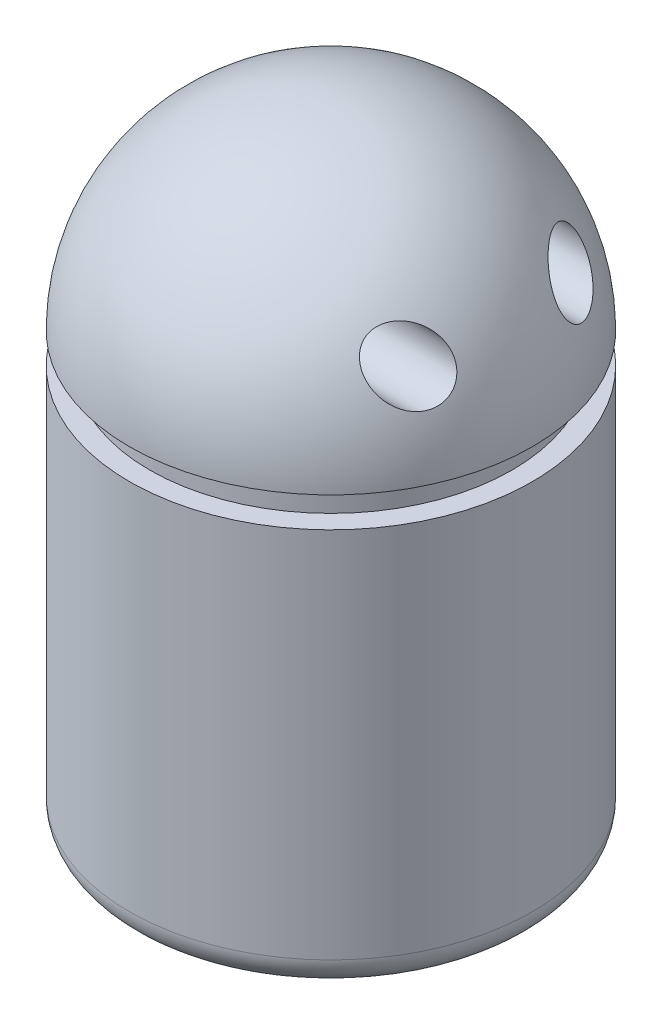
ISO-10303-21;
HEADER;
FILE_DESCRIPTION(('STEP AP214'),'2;1');
FILE_NAME('part.step','',(''),(''),'','','');
FILE_SCHEMA(('AUTOMOTIVE_DESIGN { 1 0 10303 214 1 1 1 1 }'));
ENDSEC;
DATA;
#1=APPLICATION_CONTEXT('core data for automotive mechanical design processes');
#2=APPLICATION_PROTOCOL_DEFINITION('international standard','automotive_design',2000,#1);
#3=PRODUCT_CONTEXT('',#1,'mechanical');
#4=PRODUCT('Part','Part','',(#3));
#5=PRODUCT_RELATED_PRODUCT_CATEGORY('part','',(#4));
#6=PRODUCT_DEFINITION_FORMATION('','',#4);
#7=PRODUCT_DEFINITION_CONTEXT('part definition',#1,'design');
#8=PRODUCT_DEFINITION('design','',#6,#7);
#9=PRODUCT_DEFINITION_SHAPE('','',#8);
#10=(LENGTH_UNIT() NAMED_UNIT(*) SI_UNIT(.MILLI.,.METRE.));
#11=(NAMED_UNIT(*) PLANE_ANGLE_UNIT() SI_UNIT($,.RADIAN.));
#12=(NAMED_UNIT(*) SI_UNIT($,.STERADIAN.) SOLID_ANGLE_UNIT());
#13=UNCERTAINTY_MEASURE_WITH_UNIT(LENGTH_MEASURE(1.E-05),#10,'distance_accuracy_value','');
#14=(GEOMETRIC_REPRESENTATION_CONTEXT(3) GLOBAL_UNCERTAINTY_ASSIGNED_CONTEXT((#13)) GLOBAL_UNIT_ASSIGNED_CONTEXT((#10,
#11,#12)) REPRESENTATION_CONTEXT('',''));
#15=CARTESIAN_POINT('',(0.,0.,0.));
#16=DIRECTION('',(0.,0.,1.));
#17=DIRECTION('',(1.,0.,0.));
#18=AXIS2_PLACEMENT_3D('',#15,#16,#17);
#19=CARTESIAN_POINT('',(0.,25.0871642546623,0.));
#20=DIRECTION('',(0.,1.,0.));
#21=DIRECTION('',(1.,0.,0.));
#22=AXIS2_PLACEMENT_3D('',#19,#20,#21);
#23=SPHERICAL_SURFACE('',#22,20.);
#24=CARTESIAN_POINT('',(0.,25.0871642546623,0.));
#25=DIRECTION('',(0.,1.,0.));
#26=DIRECTION('',(-1.,0.,0.));
#27=AXIS2_PLACEMENT_3D('',#24,#25,#26);
#28=CIRCLE('',#27,20.);
#29=CARTESIAN_POINT('',(-20.,25.0871642546623,0.));
#30=VERTEX_POINT('',#29);
#31=EDGE_CURVE('E112',#30,#30,#28,.T.);
#32=ORIENTED_EDGE('',*,*,#31,.T.);
#33=EDGE_LOOP('',(#32));
#34=FACE_BOUND('',#33,.T.);
#35=CARTESIAN_POINT('',(13.4453803624694,35.4923678170798,10.5334460521321));
#36=CARTESIAN_POINT('',(13.4831385515583,35.3560480628861,10.6199105739937));
#37=CARTESIAN_POINT('',(13.5313318289137,35.2148373811901,10.6939581733344));
#38=CARTESIAN_POINT('',(13.6442427149102,34.9283095678289,10.8173048911098));
#39=CARTESIAN_POINT('',(13.7089830796458,34.7829870281411,10.8665696481899));
#40=CARTESIAN_POINT('',(13.8500880606045,34.4939172377159,10.9414380525515));
#41=CARTESIAN_POINT('',(13.9263343192429,34.3501683330391,10.967265714894));
#42=CARTESIAN_POINT('',(14.0875707577707,34.0655193939873,10.9980236385453));
#43=CARTESIAN_POINT('',(14.1725620951018,33.9246197396809,11.0029511299904));
#44=CARTESIAN_POINT('',(14.3898642171455,33.5827313110201,10.9915922824336));
#45=CARTESIAN_POINT('',(14.5257628345021,33.384353064386,10.9643448851447));
#46=CARTESIAN_POINT('',(14.8049642687162,33.0015551148971,10.8735380860272));
#47=CARTESIAN_POINT('',(14.9482776658411,32.8171563385145,10.8099254174093));
#48=CARTESIAN_POINT('',(15.2392787226244,32.4642221290427,10.6490700218289));
#49=CARTESIAN_POINT('',(15.3869947818485,32.2958514701946,10.5515178584433));
#50=CARTESIAN_POINT('',(15.681879644939,31.9806023903941,10.3256252037855));
#51=CARTESIAN_POINT('',(15.8290483289229,31.8337284351558,10.1972783298105));
#52=CARTESIAN_POINT('',(16.1323426768213,31.5538219890677,9.89950538785618));
#53=CARTESIAN_POINT('',(16.2881051801146,31.4231722531734,9.72744563742472));
#54=CARTESIAN_POINT('',(16.590084390311,31.199277307521,9.3531448476486));
#55=CARTESIAN_POINT('',(16.7363118262348,31.1059894275718,9.15093860240877));
#56=CARTESIAN_POINT('',(16.9763118126462,30.9838115469594,8.77907702329936));
#57=CARTESIAN_POINT('',(17.0736593654515,30.9443742831044,8.61516345233622));
#58=CARTESIAN_POINT('',(17.2572573898673,30.8935716099865,8.27708875406138));
#59=CARTESIAN_POINT('',(17.3435228112316,30.8821679984158,8.10294190389709));
#60=CARTESIAN_POINT('',(17.4894142450262,30.8902167371029,7.77636744768058));
#61=CARTESIAN_POINT('',(17.5510968627123,30.9051688662297,7.62474723854912));
#62=CARTESIAN_POINT('',(17.6619820869591,30.9593980325332,7.32106813990853));
#63=CARTESIAN_POINT('',(17.711187968161,30.9986686777448,7.16900937612084));
#64=CARTESIAN_POINT('',(17.7740283006471,31.0764880833818,6.94397251996637));
#65=CARTESIAN_POINT('',(17.7931968677371,31.1057224982337,6.86920031870342));
#66=CARTESIAN_POINT('',(17.8275456182224,31.1704856736673,6.72150287856969));
#67=CARTESIAN_POINT('',(17.842727718818,31.2060113947727,6.64857676716854));
#68=CARTESIAN_POINT('',(17.8688802404139,31.2832207535645,6.50528978713338));
#69=CARTESIAN_POINT('',(17.879851688827,31.3249028856246,6.43492829652064));
#70=CARTESIAN_POINT('',(17.8974232257632,31.4141399134806,6.29749309543194));
#71=CARTESIAN_POINT('',(17.9040238311959,31.4616941140377,6.2304189970477));
#72=CARTESIAN_POINT('',(17.9161191012227,31.6014701462796,6.04961874530937));
#73=CARTESIAN_POINT('',(17.9167780081026,31.699710816695,5.94009529202683));
#74=CARTESIAN_POINT('',(17.903855130754,31.9105958706815,5.73709324226676));
#75=CARTESIAN_POINT('',(17.8902769302641,32.0232366232247,5.64361061491271));
#76=CARTESIAN_POINT('',(17.8503209367939,32.2549989474597,5.4779673889344));
#77=CARTESIAN_POINT('',(17.8244171437574,32.3737458588901,5.4051650033801));
#78=CARTESIAN_POINT('',(17.7611394566127,32.6176634396438,5.27763792350556));
#79=CARTESIAN_POINT('',(17.723763618381,32.7428351947643,5.2229162965286));
#80=CARTESIAN_POINT('',(17.6361103677206,33.0046819674143,5.12866296289856));
#81=CARTESIAN_POINT('',(17.5851434835901,33.1415704612395,5.0903743454242));
#82=CARTESIAN_POINT('',(17.4735005250467,33.4154711196541,5.03376476484332));
#83=CARTESIAN_POINT('',(17.4128202256916,33.5524833121425,5.01545251785937));
#84=CARTESIAN_POINT('',(17.2744789442787,33.8426516128093,4.99631712430197));
#85=CARTESIAN_POINT('',(17.1956301639029,33.9954203225939,4.99826244241785));
#86=CARTESIAN_POINT('',(17.0297545262585,34.2944640541906,5.02419626166686));
#87=CARTESIAN_POINT('',(16.9427229997045,34.4407352974281,5.04819741780212));
#88=CARTESIAN_POINT('',(16.7464902932733,34.7495240314543,5.12196397920605));
#89=CARTESIAN_POINT('',(16.6360833801165,34.9103689767533,5.1755209174127));
#90=CARTESIAN_POINT('',(16.4091937170986,35.2172880774052,5.30657532431823));
#91=CARTESIAN_POINT('',(16.2927076798265,35.3633541126322,5.38408586028323));
#92=CARTESIAN_POINT('',(16.0355303308101,35.6623724852479,5.57517532209032));
#93=CARTESIAN_POINT('',(15.8941126398515,35.8122132364643,5.69265943921267));
#94=CARTESIAN_POINT('',(15.60906843295,36.0863318760455,5.95242516587325));
#95=CARTESIAN_POINT('',(15.465439846816,36.2105840143231,6.09473149092368));
#96=CARTESIAN_POINT('',(15.1634789705839,36.4428988706325,6.4175672762193));
#97=CARTESIAN_POINT('',(15.0052627691149,36.5476886792573,6.60057755589191));
#98=CARTESIAN_POINT('',(14.6951125559464,36.7180439115649,6.98893175362697));
#99=CARTESIAN_POINT('',(14.5431740215666,36.7836380487796,7.19425919218186));
#100=CARTESIAN_POINT('',(14.2892576531945,36.8589004422977,7.56847654343141));
#101=CARTESIAN_POINT('',(14.1843775128908,36.8785296933862,7.73341151745024));
#102=CARTESIAN_POINT('',(13.9858677404892,36.8895083261498,8.07083330464297));
#103=CARTESIAN_POINT('',(13.8922198189739,36.8809043462227,8.24330719962286));
#104=CARTESIAN_POINT('',(13.7399095928964,36.8372056013013,8.55423823433762));
#105=CARTESIAN_POINT('',(13.6780601893566,36.8082373429673,8.6919919345829));
#106=CARTESIAN_POINT('',(13.5676903375387,36.7290832664489,8.96699100592251));
#107=CARTESIAN_POINT('',(13.5191635170006,36.678907621134,9.10423658895351));
#108=CARTESIAN_POINT('',(13.4588295603924,36.5869836249812,9.3069911950982));
#109=CARTESIAN_POINT('',(13.4407323484368,36.5533430381133,9.37440455268632));
#110=CARTESIAN_POINT('',(13.409231718004,36.4805588078798,9.50731508602419));
#111=CARTESIAN_POINT('',(13.3958257457582,36.4414181748885,9.57281328647429));
#112=CARTESIAN_POINT('',(13.3740501583254,36.3578443011119,9.70116157814492));
#113=CARTESIAN_POINT('',(13.3656773283825,36.3134144604112,9.7640133357836));
#114=CARTESIAN_POINT('',(13.3541808581406,36.2195892871721,9.88640192922896));
#115=CARTESIAN_POINT('',(13.3510566075058,36.1701945326912,9.94593914969092));
#116=CARTESIAN_POINT('',(13.350193564726,36.0723692784738,10.0549682391708));
#117=CARTESIAN_POINT('',(13.3519220996157,36.0243853878409,10.1048576102253));
#118=CARTESIAN_POINT('',(13.3596033271491,35.9252582873451,10.2010543075184));
#119=CARTESIAN_POINT('',(13.3655574496202,35.8741140134409,10.2473604153916));
#120=CARTESIAN_POINT('',(13.3895932369203,35.7166415701585,10.3803710602372));
#121=CARTESIAN_POINT('',(13.4138480142911,35.6062101929069,10.4612384205111));
#122=CARTESIAN_POINT('',(13.4453803624694,35.4923678170798,10.5334460521321));
#123=B_SPLINE_CURVE_WITH_KNOTS('',3,(#35,#36,#37,#38,#39,#40,#41,#42,#43,#44,#45,#46,#47,#48,
#49,#50,#51,#52,#53,#54,#55,#56,#57,#58,#59,#60,#61,#62,#63,#64,#65,#66,#67,#68,#69,#70,#71,#72,
#73,#74,#75,#76,#77,#78,#79,#80,#81,#82,#83,#84,#85,#86,#87,#88,#89,#90,#91,#92,#93,#94,#95,#96,
#97,#98,#99,#100,#101,#102,#103,#104,#105,#106,#107,#108,#109,#110,#111,#112,#113,#114,#115,
#116,#117,#118,#119,#120,#121,#122),.UNSPECIFIED.,.T.,.F.,(4,2,2,2,2,2,2,2,2,2,2,2,2,2,2,2,2,2,
2,2,2,2,2,2,2,2,2,2,2,2,2,2,2,2,2,2,2,2,2,2,2,2,2,4),(0.,0.496589031718136,0.993864698316754,
1.48633567664974,1.97887191927895,2.70103270944641,3.42425402002835,4.15424985801562,
4.88439713036922,5.67929855199498,6.47328952669972,7.05509791682352,7.63611301842491,
8.12725111990935,8.61826018367271,8.86558504956768,9.11279075143634,9.35993609590552,
9.60705220696593,10.0459918403922,10.4848210112505,10.907991973654,11.3312346888525,
11.7824527125496,12.2338675337831,12.7477023321604,13.2618321382933,13.8664631882613,
14.4714246630631,15.1800874077427,15.8894598395107,16.676677665557,17.4633180910052,
18.0505794890246,18.6368712802035,19.0964644654646,19.5558374404332,19.7879880674786,
20.020012121447,20.251887819697,20.4837365522084,20.6911605214273,20.8986547109362,
21.3133625829895),.UNSPECIFIED.);
#124=CARTESIAN_POINT('',(13.4453803624694,35.4923678170798,10.5334460521321));
#125=VERTEX_POINT('',#124);
#126=EDGE_CURVE('E69',#125,#125,#123,.T.);
#127=ORIENTED_EDGE('',*,*,#126,.F.);
#128=EDGE_LOOP('',(#127));
#129=FACE_BOUND('',#128,.T.);
#130=CARTESIAN_POINT('',(13.4453803624694,35.4923678170798,-10.5334460521321));
#131=CARTESIAN_POINT('',(13.4158646983301,35.598929537346,-10.4658556886057));
#132=CARTESIAN_POINT('',(13.3926840680982,35.7026123041998,-10.3906248174243));
#133=CARTESIAN_POINT('',(13.3607060949506,35.9008040454227,-10.2261234510468));
#134=CARTESIAN_POINT('',(13.3519232028405,35.9953037134903,-10.1368389487814));
#135=CARTESIAN_POINT('',(13.3494640912565,36.1720504139007,-9.94655570270381));
#136=CARTESIAN_POINT('',(13.3557969603757,36.2542900431139,-9.84554994603682));
#137=CARTESIAN_POINT('',(13.3830820607704,36.404169105101,-9.63511272506071));
#138=CARTESIAN_POINT('',(13.4040336809177,36.4718091480472,-9.52568161313875));
#139=CARTESIAN_POINT('',(13.4587464743722,36.590835521968,-9.30291438918817));
#140=CARTESIAN_POINT('',(13.4923747578717,36.6423806625916,-9.18962951774432));
#141=CARTESIAN_POINT('',(13.5704780506305,36.7301921799123,-8.96094782173622));
#142=CARTESIAN_POINT('',(13.6149587947713,36.7664504506784,-8.84554991047601));
#143=CARTESIAN_POINT('',(13.7332468560269,36.8364684166714,-8.56650527265603));
#144=CARTESIAN_POINT('',(13.8115350441136,36.8628244550972,-8.40288872505927));
#145=CARTESIAN_POINT('',(13.9808214851998,36.8889344208073,-8.08012363344789));
#146=CARTESIAN_POINT('',(14.0718460810461,36.8886323739835,-7.92098519252467));
#147=CARTESIAN_POINT('',(14.2893935805296,36.8608141336427,-7.56631562345827));
#148=CARTESIAN_POINT('',(14.4187114334163,36.8256872891957,-7.37309905703569));
#149=CARTESIAN_POINT('',(14.6855598643192,36.7214331798981,-7.00236574760609));
#150=CARTESIAN_POINT('',(14.8230946028621,36.6522885601276,-6.82485707292388));
#151=CARTESIAN_POINT('',(15.1039635536739,36.4826354489429,-6.48612535133025));
#152=CARTESIAN_POINT('',(15.2473503113133,36.3817255957484,-6.32514778248487));
#153=CARTESIAN_POINT('',(15.5346926788118,36.151839972101,-6.02516993282366));
#154=CARTESIAN_POINT('',(15.6786484827104,36.0228536374749,-5.88617795848116));
#155=CARTESIAN_POINT('',(15.9804735662073,35.722992018574,-5.61905505414908));
#156=CARTESIAN_POINT('',(16.1380274430434,35.5489980206046,-5.49403721011682));
#157=CARTESIAN_POINT('',(16.4452586947804,35.173119254424,-5.28176167011965));
#158=CARTESIAN_POINT('',(16.5949422020456,34.971256659002,-5.19447418099817));
#159=CARTESIAN_POINT('',(16.8470085332183,34.5955830029491,-5.08026825777102));
#160=CARTESIAN_POINT('',(16.9521849369037,34.4264881655973,-5.04393792281258));
#161=CARTESIAN_POINT('',(17.1518397814388,34.0784917493828,-5.00109654246142));
#162=CARTESIAN_POINT('',(17.2463326831365,33.8996039251471,-4.9945447069936));
#163=CARTESIAN_POINT('',(17.4069274345922,33.5662976716411,-5.0131578093004));
#164=CARTESIAN_POINT('',(17.4751479913268,33.4126214047409,-5.03334645782764));
#165=CARTESIAN_POINT('',(17.5993155059513,33.1054510937987,-5.0989801671158));
#166=CARTESIAN_POINT('',(17.6552653275532,32.9519570155726,-5.14441932621246));
#167=CARTESIAN_POINT('',(17.7282148284535,32.7252918882465,-5.23227231097536));
#168=CARTESIAN_POINT('',(17.7507704364888,32.6500373584656,-5.26501101500455));
#169=CARTESIAN_POINT('',(17.7918284654547,32.5016071859071,-5.33704858199191));
#170=CARTESIAN_POINT('',(17.8103329182706,32.4284305170664,-5.37634413880596));
#171=CARTESIAN_POINT('',(17.8430141252577,32.2849188299343,-5.46135477177209));
#172=CARTESIAN_POINT('',(17.8571923583894,32.2145828476769,-5.50706764628089));
#173=CARTESIAN_POINT('',(17.8810088473723,32.0775167352073,-5.60461604662418));
#174=CARTESIAN_POINT('',(17.8906477494486,32.0107860929323,-5.65645069963955));
#175=CARTESIAN_POINT('',(17.9107051989468,31.8329476401285,-5.80716748552025));
#176=CARTESIAN_POINT('',(17.9162444046389,31.7262650700169,-5.91208323881214));
#177=CARTESIAN_POINT('',(17.9124965592287,31.5299278493289,-6.13640813916594));
#178=CARTESIAN_POINT('',(17.9032147664524,31.4402671722004,-6.2558121320745));
#179=CARTESIAN_POINT('',(17.8712423769709,31.2846762479242,-6.49841641401209));
#180=CARTESIAN_POINT('',(17.849300271535,31.217728594321,-6.62106658654284));
#181=CARTESIAN_POINT('',(17.7935918475913,31.1022547031493,-6.87216546526775));
#182=CARTESIAN_POINT('',(17.7598242063723,31.0537305275516,-7.00061481871195));
#183=CARTESIAN_POINT('',(17.6797558248141,30.9731609499697,-7.26658430054409));
#184=CARTESIAN_POINT('',(17.6328987386091,30.9420939742314,-7.40423068629115));
#185=CARTESIAN_POINT('',(17.5292295718495,30.8996274366313,-7.6787622392922));
#186=CARTESIAN_POINT('',(17.4724134487415,30.8882358818377,-7.81564707404969));
#187=CARTESIAN_POINT('',(17.3425964541826,30.8835175840484,-8.1033724213904));
#188=CARTESIAN_POINT('',(17.2684532071469,30.8927110461314,-8.25373503364917));
#189=CARTESIAN_POINT('',(17.1117304385671,30.9322012762814,-8.54706463029031));
#190=CARTESIAN_POINT('',(17.0291462658822,30.9625097332649,-8.69002747116453));
#191=CARTESIAN_POINT('',(16.8425740480016,31.0487656204242,-8.99030276211326));
#192=CARTESIAN_POINT('',(16.7373514842278,31.1082344515853,-9.14583522807365));
#193=CARTESIAN_POINT('',(16.5204149875339,31.2494846808207,-9.44141745501021));
#194=CARTESIAN_POINT('',(16.4086974218015,31.3312786622471,-9.5814584216098));
#195=CARTESIAN_POINT('',(16.1608832870383,31.5301875170159,-9.86745219708467));
#196=CARTESIAN_POINT('',(16.0239497274398,31.6509821970311,-10.0101275016743));
#197=CARTESIAN_POINT('',(15.7470580488079,31.9150037900251,-10.2695809541939));
#198=CARTESIAN_POINT('',(15.6070973238967,32.0582507517159,-10.386335729097));
#199=CARTESIAN_POINT('',(15.3096891981131,32.3826279363443,-10.6045831562373));
#200=CARTESIAN_POINT('',(15.1522305162312,32.5662537933379,-10.7023751893496));
#201=CARTESIAN_POINT('',(14.8417987797107,32.9529946072782,-10.8589707855588));
#202=CARTESIAN_POINT('',(14.688823931401,33.1561016283162,-10.9177901481164));
#203=CARTESIAN_POINT('',(14.4236206562796,33.5340481340405,-10.9841736846133));
#204=CARTESIAN_POINT('',(14.3094720847854,33.7061366243991,-10.9997783484113));
#205=CARTESIAN_POINT('',(14.0917675490524,34.0571037669916,-11.0002163406899));
#206=CARTESIAN_POINT('',(13.9882018235543,34.2359759494655,-10.9850782992608));
#207=CARTESIAN_POINT('',(13.8188839743938,34.5555219145814,-10.9276830595413));
#208=CARTESIAN_POINT('',(13.7498725351796,34.6957074990701,-10.8923159905561));
#209=CARTESIAN_POINT('',(13.6251272921572,34.9743436264412,-10.7992995577861));
#210=CARTESIAN_POINT('',(13.5693475779758,35.1127985413618,-10.7417291155208));
#211=CARTESIAN_POINT('',(13.5076573394018,35.2895176475792,-10.6516455410847));
#212=CARTESIAN_POINT('',(13.4940219268909,35.3305665515595,-10.6295080562011));
#213=CARTESIAN_POINT('',(13.4684198427684,35.4120016169782,-10.5830884645494));
#214=CARTESIAN_POINT('',(13.4564542284101,35.4523873443699,-10.5588050147846));
#215=CARTESIAN_POINT('',(13.4453803624694,35.4923678170798,-10.5334460521321));
#216=B_SPLINE_CURVE_WITH_KNOTS('',3,(#130,#131,#132,#133,#134,#135,#136,#137,#138,#139,#140,
#141,#142,#143,#144,#145,#146,#147,#148,#149,#150,#151,#152,#153,#154,#155,#156,#157,#158,#159,
#160,#161,#162,#163,#164,#165,#166,#167,#168,#169,#170,#171,#172,#173,#174,#175,#176,#177,#178,
#179,#180,#181,#182,#183,#184,#185,#186,#187,#188,#189,#190,#191,#192,#193,#194,#195,#196,#197,
#198,#199,#200,#201,#202,#203,#204,#205,#206,#207,#208,#209,#210,#211,#212,#213,#214,#215),
.UNSPECIFIED.,.T.,.F.,(4,2,2,2,2,2,2,2,2,2,2,2,2,2,2,2,2,2,2,2,2,2,2,2,2,2,2,2,2,2,2,2,2,2,2,2,
2,2,2,2,2,2,4),(0.,0.388607904121306,0.777605610209473,1.16683726630109,1.55605265176642,
1.94129649488554,2.32674435913799,2.87359187660103,3.42158763965096,4.1233133949417,
4.82539752295709,5.53673505394516,6.24834069983095,7.04221043165986,7.83545214699752,
8.44039077551558,9.04450051930576,9.55053792035586,10.0564570977564,10.3114773399711,
10.566369380458,10.8211741857305,11.0759427056936,11.5225717734566,11.9690424173854,
12.3914857505695,12.8139763500308,13.2582462848364,13.7026969762453,14.2044876786893,
14.7065563852339,15.2952499387592,15.8842759912948,16.5766997574112,17.2697453816613,
18.0489306114634,18.827799767186,19.4468554731248,20.0653349287673,20.5442564273424,
21.021491067327,21.1671994959344,21.312999767052),.UNSPECIFIED.);
#217=CARTESIAN_POINT('',(13.4453803624694,35.4923678170798,-10.5334460521321));
#218=VERTEX_POINT('',#217);
#219=EDGE_CURVE('E51',#218,#218,#216,.T.);
#220=ORIENTED_EDGE('',*,*,#219,.F.);
#221=EDGE_LOOP('',(#220));
#222=FACE_BOUND('',#221,.T.);
#223=ADVANCED_FACE('F47',(#34,#129,#222),#23,.T.);
#224=CARTESIAN_POINT('',(0.,-17.9128357453377,0.));
#225=DIRECTION('',(0.,1.,0.));
#226=DIRECTION('',(-1.,0.,0.));
#227=AXIS2_PLACEMENT_3D('',#224,#225,#226);
#228=PLANE('',#227);
#229=CARTESIAN_POINT('',(0.,-17.9128357453377,0.));
#230=DIRECTION('',(0.,1.,0.));
#231=DIRECTION('',(-1.,0.,0.));
#232=AXIS2_PLACEMENT_3D('',#229,#230,#231);
#233=CIRCLE('',#232,17.);
#234=CARTESIAN_POINT('',(-17.,-17.9128357453377,0.));
#235=VERTEX_POINT('',#234);
#236=EDGE_CURVE('E12',#235,#235,#233,.F.);
#237=ORIENTED_EDGE('',*,*,#236,.T.);
#238=EDGE_LOOP('',(#237));
#239=FACE_BOUND('',#238,.T.);
#240=ADVANCED_FACE('F100',(#239),#228,.F.);
#241=CARTESIAN_POINT('',(0.,45.0871642546623,0.));
#242=DIRECTION('',(0.,1.,0.));
#243=DIRECTION('',(-1.,0.,0.));
#244=AXIS2_PLACEMENT_3D('',#241,#242,#243);
#245=CYLINDRICAL_SURFACE('',#244,20.);
#246=CARTESIAN_POINT('',(0.,-14.9128357453377,0.));
#247=DIRECTION('',(0.,1.,0.));
#248=DIRECTION('',(-1.,0.,0.));
#249=AXIS2_PLACEMENT_3D('',#246,#247,#248);
#250=CIRCLE('',#249,20.);
#251=CARTESIAN_POINT('',(-20.,-14.9128357453377,0.));
#252=VERTEX_POINT('',#251);
#253=EDGE_CURVE('E60',#252,#252,#250,.T.);
#254=ORIENTED_EDGE('',*,*,#253,.T.);
#255=EDGE_LOOP('',(#254));
#256=FACE_BOUND('',#255,.T.);
#257=CARTESIAN_POINT('',(0.,22.0839005854841,0.));
#258=DIRECTION('',(0.,1.,0.));
#259=DIRECTION('',(-1.,0.,0.));
#260=AXIS2_PLACEMENT_3D('',#257,#258,#259);
#261=CIRCLE('',#260,20.);
#262=CARTESIAN_POINT('',(-20.,22.0839005854841,0.));
#263=VERTEX_POINT('',#262);
#264=EDGE_CURVE('E66',#263,#263,#261,.T.);
#265=ORIENTED_EDGE('',*,*,#264,.F.);
#266=EDGE_LOOP('',(#265));
#267=FACE_BOUND('',#266,.T.);
#268=ADVANCED_FACE('F97',(#256,#267),#245,.T.);
#269=CARTESIAN_POINT('',(18.,22.0839005854841,0.));
#270=DIRECTION('',(0.,-1.,0.));
#271=DIRECTION('',(1.,0.,0.));
#272=AXIS2_PLACEMENT_3D('',#269,#270,#271);
#273=PLANE('',#272);
#274=CARTESIAN_POINT('',(0.,22.0839005854841,0.));
#275=DIRECTION('',(0.,1.,0.));
#276=DIRECTION('',(-1.,0.,0.));
#277=AXIS2_PLACEMENT_3D('',#274,#275,#276);
#278=CIRCLE('',#277,18.);
#279=CARTESIAN_POINT('',(-18.,22.0839005854841,0.));
#280=VERTEX_POINT('',#279);
#281=EDGE_CURVE('E124',#280,#280,#278,.T.);
#282=ORIENTED_EDGE('',*,*,#281,.F.);
#283=EDGE_LOOP('',(#282));
#284=FACE_BOUND('',#283,.T.);
#285=ORIENTED_EDGE('',*,*,#264,.T.);
#286=EDGE_LOOP('',(#285));
#287=FACE_BOUND('',#286,.T.);
#288=ADVANCED_FACE('F93',(#284,#287),#273,.F.);
#289=CARTESIAN_POINT('',(0.,45.0871642546623,0.));
#290=DIRECTION('',(0.,1.,0.));
#291=DIRECTION('',(-1.,0.,0.));
#292=AXIS2_PLACEMENT_3D('',#289,#290,#291);
#293=CYLINDRICAL_SURFACE('',#292,18.);
#294=CARTESIAN_POINT('',(0.,25.0871642546623,0.));
#295=DIRECTION('',(0.,1.,0.));
#296=DIRECTION('',(-1.,0.,0.));
#297=AXIS2_PLACEMENT_3D('',#294,#295,#296);
#298=CIRCLE('',#297,18.);
#299=CARTESIAN_POINT('',(-18.,25.0871642546623,0.));
#300=VERTEX_POINT('',#299);
#301=EDGE_CURVE('E120',#300,#300,#298,.T.);
#302=ORIENTED_EDGE('',*,*,#301,.F.);
#303=EDGE_LOOP('',(#302));
#304=FACE_BOUND('',#303,.T.);
#305=ORIENTED_EDGE('',*,*,#281,.T.);
#306=EDGE_LOOP('',(#305));
#307=FACE_BOUND('',#306,.T.);
#308=ADVANCED_FACE('F89',(#304,#307),#293,.T.);
#309=CARTESIAN_POINT('',(20.,25.0871642546623,0.));
#310=DIRECTION('',(0.,1.,0.));
#311=DIRECTION('',(-1.,0.,0.));
#312=AXIS2_PLACEMENT_3D('',#309,#310,#311);
#313=PLANE('',#312);
#314=ORIENTED_EDGE('',*,*,#31,.F.);
#315=EDGE_LOOP('',(#314));
#316=FACE_BOUND('',#315,.T.);
#317=ORIENTED_EDGE('',*,*,#301,.T.);
#318=EDGE_LOOP('',(#317));
#319=FACE_BOUND('',#318,.T.);
#320=ADVANCED_FACE('F86',(#316,#319),#313,.F.);
#321=CARTESIAN_POINT('',(0.,-14.9128357453377,0.));
#322=DIRECTION('',(0.,1.,0.));
#323=DIRECTION('',(-1.,0.,0.));
#324=AXIS2_PLACEMENT_3D('',#321,#322,#323);
#325=TOROIDAL_SURFACE('',#324,17.,3.);
#326=ORIENTED_EDGE('',*,*,#236,.F.);
#327=EDGE_LOOP('',(#326));
#328=FACE_BOUND('',#327,.T.);
#329=ORIENTED_EDGE('',*,*,#253,.F.);
#330=EDGE_LOOP('',(#329));
#331=FACE_BOUND('',#330,.T.);
#332=ADVANCED_FACE('F49',(#328,#331),#325,.T.);
#333=CARTESIAN_POINT('',(18.,33.8856160935903,8.));
#334=DIRECTION('',(-1.,0.,0.));
#335=DIRECTION('',(0.,0.,1.));
#336=AXIS2_PLACEMENT_3D('',#333,#334,#335);
#337=CYLINDRICAL_SURFACE('',#336,3.);
#338=CARTESIAN_POINT('',(0.,33.8856160935903,8.));
#339=DIRECTION('',(1.,0.,0.));
#340=DIRECTION('',(0.,0.,1.));
#341=AXIS2_PLACEMENT_3D('',#338,#339,#340);
#342=CIRCLE('',#341,3.);
#343=CARTESIAN_POINT('',(0.,33.8856160935903,11.));
#344=VERTEX_POINT('',#343);
#345=EDGE_CURVE('E127',#344,#344,#342,.T.);
#346=ORIENTED_EDGE('',*,*,#345,.F.);
#347=EDGE_LOOP('',(#346));
#348=FACE_BOUND('',#347,.T.);
#349=ORIENTED_EDGE('',*,*,#126,.T.);
#350=EDGE_LOOP('',(#349));
#351=FACE_BOUND('',#350,.T.);
#352=ADVANCED_FACE('F79',(#348,#351),#337,.F.);
#353=CARTESIAN_POINT('',(0.,33.8856160935903,8.));
#354=DIRECTION('',(-1.,0.,0.));
#355=DIRECTION('',(0.,0.,1.));
#356=AXIS2_PLACEMENT_3D('',#353,#354,#355);
#357=PLANE('',#356);
#358=ORIENTED_EDGE('',*,*,#345,.T.);
#359=EDGE_LOOP('',(#358));
#360=FACE_BOUND('',#359,.T.);
#361=ADVANCED_FACE('F84',(#360),#357,.F.);
#362=CARTESIAN_POINT('',(18.,33.8856160935903,-8.));
#363=DIRECTION('',(-1.,0.,0.));
#364=DIRECTION('',(0.,0.,1.));
#365=AXIS2_PLACEMENT_3D('',#362,#363,#364);
#366=CYLINDRICAL_SURFACE('',#365,3.);
#367=CARTESIAN_POINT('',(0.,33.8856160935903,-8.));
#368=DIRECTION('',(1.,0.,0.));
#369=DIRECTION('',(0.,0.,-1.));
#370=AXIS2_PLACEMENT_3D('',#367,#368,#369);
#371=CIRCLE('',#370,3.);
#372=CARTESIAN_POINT('',(0.,33.8856160935903,-11.));
#373=VERTEX_POINT('',#372);
#374=EDGE_CURVE('E76',#373,#373,#371,.T.);
#375=ORIENTED_EDGE('',*,*,#374,.F.);
#376=EDGE_LOOP('',(#375));
#377=FACE_BOUND('',#376,.T.);
#378=ORIENTED_EDGE('',*,*,#219,.T.);
#379=EDGE_LOOP('',(#378));
#380=FACE_BOUND('',#379,.T.);
#381=ADVANCED_FACE('F147',(#377,#380),#366,.F.);
#382=CARTESIAN_POINT('',(0.,33.8856160935903,-8.));
#383=DIRECTION('',(1.,0.,0.));
#384=DIRECTION('',(0.,0.,-1.));
#385=AXIS2_PLACEMENT_3D('',#382,#383,#384);
#386=PLANE('',#385);
#387=ORIENTED_EDGE('',*,*,#374,.T.);
#388=EDGE_LOOP('',(#387));
#389=FACE_BOUND('',#388,.T.);
#390=ADVANCED_FACE('F145',(#389),#386,.T.);
#391=CLOSED_SHELL('',(#223,#240,#268,#288,#308,#320,#332,#352,#361,#381,#390));
#392=MANIFOLD_SOLID_BREP('B2',#391);
#393=ADVANCED_BREP_SHAPE_REPRESENTATION('',(#18,#392),#14);
#394=SHAPE_DEFINITION_REPRESENTATION(#9,#393);
ENDSEC;
END-ISO-10303-21;
